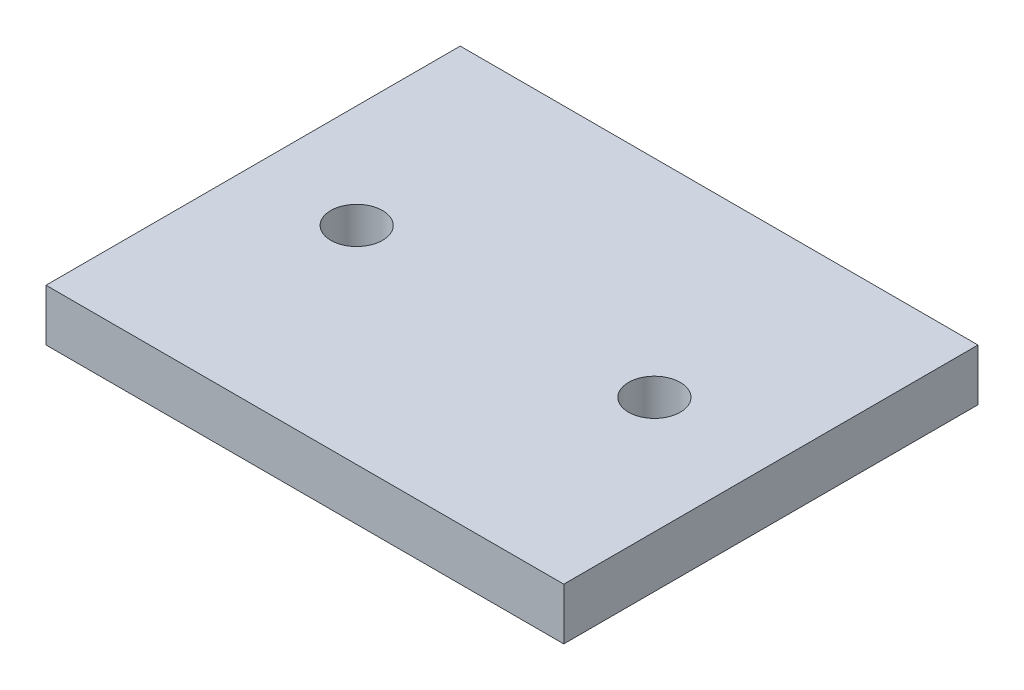
ISO-10303-21;
HEADER;
FILE_DESCRIPTION(('STEP AP214'),'2;1');
FILE_NAME('part.step','',(''),(''),'','','');
FILE_SCHEMA(('AUTOMOTIVE_DESIGN { 1 0 10303 214 1 1 1 1 }'));
ENDSEC;
DATA;
#1=APPLICATION_CONTEXT('core data for automotive mechanical design processes');
#2=APPLICATION_PROTOCOL_DEFINITION('international standard','automotive_design',2000,#1);
#3=PRODUCT_CONTEXT('',#1,'mechanical');
#4=PRODUCT('Part','Part','',(#3));
#5=PRODUCT_RELATED_PRODUCT_CATEGORY('part','',(#4));
#6=PRODUCT_DEFINITION_FORMATION('','',#4);
#7=PRODUCT_DEFINITION_CONTEXT('part definition',#1,'design');
#8=PRODUCT_DEFINITION('design','',#6,#7);
#9=PRODUCT_DEFINITION_SHAPE('','',#8);
#10=(LENGTH_UNIT() NAMED_UNIT(*) SI_UNIT(.MILLI.,.METRE.));
#11=(NAMED_UNIT(*) PLANE_ANGLE_UNIT() SI_UNIT($,.RADIAN.));
#12=(NAMED_UNIT(*) SI_UNIT($,.STERADIAN.) SOLID_ANGLE_UNIT());
#13=UNCERTAINTY_MEASURE_WITH_UNIT(LENGTH_MEASURE(1.E-05),#10,'distance_accuracy_value','');
#14=(GEOMETRIC_REPRESENTATION_CONTEXT(3) GLOBAL_UNCERTAINTY_ASSIGNED_CONTEXT((#13)) GLOBAL_UNIT_ASSIGNED_CONTEXT((#10,
#11,#12)) REPRESENTATION_CONTEXT('',''));
#15=CARTESIAN_POINT('',(0.,0.,0.));
#16=DIRECTION('',(0.,0.,1.));
#17=DIRECTION('',(1.,0.,0.));
#18=AXIS2_PLACEMENT_3D('',#15,#16,#17);
#19=CARTESIAN_POINT('',(0.,12.7,0.));
#20=DIRECTION('',(0.,1.,0.));
#21=DIRECTION('',(0.,0.,1.));
#22=AXIS2_PLACEMENT_3D('',#19,#20,#21);
#23=PLANE('',#22);
#24=CARTESIAN_POINT('',(25.4,12.7,50.8));
#25=DIRECTION('',(0.,1.,0.));
#26=DIRECTION('',(0.,0.,1.));
#27=AXIS2_PLACEMENT_3D('',#24,#25,#26);
#28=CIRCLE('',#27,6.35);
#29=CARTESIAN_POINT('',(25.4,12.7,57.15));
#30=VERTEX_POINT('',#29);
#31=EDGE_CURVE('E112',#30,#30,#28,.T.);
#32=ORIENTED_EDGE('',*,*,#31,.F.);
#33=EDGE_LOOP('',(#32));
#34=FACE_BOUND('',#33,.T.);
#35=DIRECTION('',(0.,0.,1.));
#36=VECTOR('',#35,1.);
#37=CARTESIAN_POINT('',(0.,12.7,0.));
#38=LINE('',#37,#36);
#39=CARTESIAN_POINT('',(0.,12.7,0.));
#40=VERTEX_POINT('',#39);
#41=CARTESIAN_POINT('',(0.,12.7,101.6));
#42=VERTEX_POINT('',#41);
#43=EDGE_CURVE('E92',#40,#42,#38,.T.);
#44=ORIENTED_EDGE('',*,*,#43,.T.);
#45=DIRECTION('',(1.,0.,0.));
#46=VECTOR('',#45,1.);
#47=CARTESIAN_POINT('',(0.,12.7,101.6));
#48=LINE('',#47,#46);
#49=CARTESIAN_POINT('',(127.,12.7,101.6));
#50=VERTEX_POINT('',#49);
#51=EDGE_CURVE('E87',#42,#50,#48,.T.);
#52=ORIENTED_EDGE('',*,*,#51,.T.);
#53=DIRECTION('',(0.,0.,-1.));
#54=VECTOR('',#53,1.);
#55=CARTESIAN_POINT('',(127.,12.7,0.));
#56=LINE('',#55,#54);
#57=CARTESIAN_POINT('',(127.,12.7,0.));
#58=VERTEX_POINT('',#57);
#59=EDGE_CURVE('E90',#50,#58,#56,.T.);
#60=ORIENTED_EDGE('',*,*,#59,.T.);
#61=DIRECTION('',(-1.,0.,0.));
#62=VECTOR('',#61,1.);
#63=CARTESIAN_POINT('',(0.,12.7,0.));
#64=LINE('',#63,#62);
#65=EDGE_CURVE('E57',#58,#40,#64,.T.);
#66=ORIENTED_EDGE('',*,*,#65,.T.);
#67=EDGE_LOOP('',(#44,#52,#60,#66));
#68=FACE_BOUND('',#67,.T.);
#69=CARTESIAN_POINT('',(98.425,12.7,50.8));
#70=DIRECTION('',(0.,1.,0.));
#71=DIRECTION('',(0.,0.,1.));
#72=AXIS2_PLACEMENT_3D('',#69,#70,#71);
#73=CIRCLE('',#72,6.35);
#74=CARTESIAN_POINT('',(98.425,12.7,57.15));
#75=VERTEX_POINT('',#74);
#76=EDGE_CURVE('E134',#75,#75,#73,.T.);
#77=ORIENTED_EDGE('',*,*,#76,.F.);
#78=EDGE_LOOP('',(#77));
#79=FACE_BOUND('',#78,.T.);
#80=ADVANCED_FACE('F39',(#34,#68,#79),#23,.T.);
#81=CARTESIAN_POINT('',(0.,0.,0.));
#82=DIRECTION('',(0.,1.,0.));
#83=DIRECTION('',(0.,0.,1.));
#84=AXIS2_PLACEMENT_3D('',#81,#82,#83);
#85=PLANE('',#84);
#86=DIRECTION('',(0.,0.,1.));
#87=VECTOR('',#86,1.);
#88=CARTESIAN_POINT('',(0.,0.,0.));
#89=LINE('',#88,#87);
#90=CARTESIAN_POINT('',(0.,0.,0.));
#91=VERTEX_POINT('',#90);
#92=CARTESIAN_POINT('',(0.,0.,101.6));
#93=VERTEX_POINT('',#92);
#94=EDGE_CURVE('E108',#91,#93,#89,.T.);
#95=ORIENTED_EDGE('',*,*,#94,.F.);
#96=DIRECTION('',(-1.,0.,0.));
#97=VECTOR('',#96,1.);
#98=CARTESIAN_POINT('',(0.,0.,0.));
#99=LINE('',#98,#97);
#100=CARTESIAN_POINT('',(127.,0.,0.));
#101=VERTEX_POINT('',#100);
#102=EDGE_CURVE('E80',#101,#91,#99,.T.);
#103=ORIENTED_EDGE('',*,*,#102,.F.);
#104=DIRECTION('',(0.,0.,-1.));
#105=VECTOR('',#104,1.);
#106=CARTESIAN_POINT('',(127.,0.,0.));
#107=LINE('',#106,#105);
#108=CARTESIAN_POINT('',(127.,0.,101.6));
#109=VERTEX_POINT('',#108);
#110=EDGE_CURVE('E74',#109,#101,#107,.T.);
#111=ORIENTED_EDGE('',*,*,#110,.F.);
#112=DIRECTION('',(1.,0.,0.));
#113=VECTOR('',#112,1.);
#114=CARTESIAN_POINT('',(0.,0.,101.6));
#115=LINE('',#114,#113);
#116=EDGE_CURVE('E97',#93,#109,#115,.T.);
#117=ORIENTED_EDGE('',*,*,#116,.F.);
#118=EDGE_LOOP('',(#95,#103,#111,#117));
#119=FACE_BOUND('',#118,.T.);
#120=CARTESIAN_POINT('',(25.4,0.,50.8));
#121=DIRECTION('',(0.,1.,0.));
#122=DIRECTION('',(0.,0.,1.));
#123=AXIS2_PLACEMENT_3D('',#120,#121,#122);
#124=CIRCLE('',#123,6.35);
#125=CARTESIAN_POINT('',(25.4,0.,57.15));
#126=VERTEX_POINT('',#125);
#127=EDGE_CURVE('E130',#126,#126,#124,.T.);
#128=ORIENTED_EDGE('',*,*,#127,.T.);
#129=EDGE_LOOP('',(#128));
#130=FACE_BOUND('',#129,.T.);
#131=CARTESIAN_POINT('',(98.425,0.,50.8));
#132=DIRECTION('',(0.,1.,0.));
#133=DIRECTION('',(0.,0.,1.));
#134=AXIS2_PLACEMENT_3D('',#131,#132,#133);
#135=CIRCLE('',#134,6.35);
#136=CARTESIAN_POINT('',(98.425,0.,57.15));
#137=VERTEX_POINT('',#136);
#138=EDGE_CURVE('E138',#137,#137,#135,.T.);
#139=ORIENTED_EDGE('',*,*,#138,.T.);
#140=EDGE_LOOP('',(#139));
#141=FACE_BOUND('',#140,.T.);
#142=ADVANCED_FACE('F125',(#119,#130,#141),#85,.F.);
#143=CARTESIAN_POINT('',(0.,12.7,0.));
#144=DIRECTION('',(1.,0.,0.));
#145=DIRECTION('',(0.,0.,-1.));
#146=AXIS2_PLACEMENT_3D('',#143,#144,#145);
#147=PLANE('',#146);
#148=ORIENTED_EDGE('',*,*,#94,.T.);
#149=DIRECTION('',(0.,-1.,0.));
#150=VECTOR('',#149,1.);
#151=CARTESIAN_POINT('',(0.,12.7,101.6));
#152=LINE('',#151,#150);
#153=EDGE_CURVE('E11',#42,#93,#152,.T.);
#154=ORIENTED_EDGE('',*,*,#153,.F.);
#155=ORIENTED_EDGE('',*,*,#43,.F.);
#156=DIRECTION('',(0.,-1.,0.));
#157=VECTOR('',#156,1.);
#158=CARTESIAN_POINT('',(0.,12.7,0.));
#159=LINE('',#158,#157);
#160=EDGE_CURVE('E104',#40,#91,#159,.T.);
#161=ORIENTED_EDGE('',*,*,#160,.T.);
#162=EDGE_LOOP('',(#148,#154,#155,#161));
#163=FACE_BOUND('',#162,.T.);
#164=ADVANCED_FACE('F41',(#163),#147,.F.);
#165=CARTESIAN_POINT('',(0.,12.7,101.6));
#166=DIRECTION('',(0.,0.,-1.));
#167=DIRECTION('',(-1.,0.,0.));
#168=AXIS2_PLACEMENT_3D('',#165,#166,#167);
#169=PLANE('',#168);
#170=ORIENTED_EDGE('',*,*,#116,.T.);
#171=DIRECTION('',(0.,-1.,0.));
#172=VECTOR('',#171,1.);
#173=CARTESIAN_POINT('',(127.,12.7,101.6));
#174=LINE('',#173,#172);
#175=EDGE_CURVE('E49',#50,#109,#174,.T.);
#176=ORIENTED_EDGE('',*,*,#175,.F.);
#177=ORIENTED_EDGE('',*,*,#51,.F.);
#178=ORIENTED_EDGE('',*,*,#153,.T.);
#179=EDGE_LOOP('',(#170,#176,#177,#178));
#180=FACE_BOUND('',#179,.T.);
#181=ADVANCED_FACE('F96',(#180),#169,.F.);
#182=CARTESIAN_POINT('',(127.,12.7,0.));
#183=DIRECTION('',(-1.,0.,0.));
#184=DIRECTION('',(0.,0.,1.));
#185=AXIS2_PLACEMENT_3D('',#182,#183,#184);
#186=PLANE('',#185);
#187=ORIENTED_EDGE('',*,*,#110,.T.);
#188=DIRECTION('',(0.,-1.,0.));
#189=VECTOR('',#188,1.);
#190=CARTESIAN_POINT('',(127.,12.7,0.));
#191=LINE('',#190,#189);
#192=EDGE_CURVE('E99',#58,#101,#191,.T.);
#193=ORIENTED_EDGE('',*,*,#192,.F.);
#194=ORIENTED_EDGE('',*,*,#59,.F.);
#195=ORIENTED_EDGE('',*,*,#175,.T.);
#196=EDGE_LOOP('',(#187,#193,#194,#195));
#197=FACE_BOUND('',#196,.T.);
#198=ADVANCED_FACE('F100',(#197),#186,.F.);
#199=CARTESIAN_POINT('',(0.,12.7,0.));
#200=DIRECTION('',(0.,0.,1.));
#201=DIRECTION('',(1.,0.,0.));
#202=AXIS2_PLACEMENT_3D('',#199,#200,#201);
#203=PLANE('',#202);
#204=ORIENTED_EDGE('',*,*,#102,.T.);
#205=ORIENTED_EDGE('',*,*,#160,.F.);
#206=ORIENTED_EDGE('',*,*,#65,.F.);
#207=ORIENTED_EDGE('',*,*,#192,.T.);
#208=EDGE_LOOP('',(#204,#205,#206,#207));
#209=FACE_BOUND('',#208,.T.);
#210=ADVANCED_FACE('F122',(#209),#203,.F.);
#211=CARTESIAN_POINT('',(25.4,12.7,50.8));
#212=DIRECTION('',(0.,-1.,0.));
#213=DIRECTION('',(0.,0.,-1.));
#214=AXIS2_PLACEMENT_3D('',#211,#212,#213);
#215=CYLINDRICAL_SURFACE('',#214,6.35);
#216=ORIENTED_EDGE('',*,*,#31,.T.);
#217=EDGE_LOOP('',(#216));
#218=FACE_BOUND('',#217,.T.);
#219=ORIENTED_EDGE('',*,*,#127,.F.);
#220=EDGE_LOOP('',(#219));
#221=FACE_BOUND('',#220,.T.);
#222=ADVANCED_FACE('F157',(#218,#221),#215,.F.);
#223=CARTESIAN_POINT('',(98.425,12.7,50.8));
#224=DIRECTION('',(0.,-1.,0.));
#225=DIRECTION('',(0.,0.,-1.));
#226=AXIS2_PLACEMENT_3D('',#223,#224,#225);
#227=CYLINDRICAL_SURFACE('',#226,6.35);
#228=ORIENTED_EDGE('',*,*,#76,.T.);
#229=EDGE_LOOP('',(#228));
#230=FACE_BOUND('',#229,.T.);
#231=ORIENTED_EDGE('',*,*,#138,.F.);
#232=EDGE_LOOP('',(#231));
#233=FACE_BOUND('',#232,.T.);
#234=ADVANCED_FACE('F146',(#230,#233),#227,.F.);
#235=CLOSED_SHELL('',(#80,#142,#164,#181,#198,#210,#222,#234));
#236=MANIFOLD_SOLID_BREP('B2',#235);
#237=ADVANCED_BREP_SHAPE_REPRESENTATION('',(#18,#236),#14);
#238=SHAPE_DEFINITION_REPRESENTATION(#9,#237);
ENDSEC;
END-ISO-10303-21;
